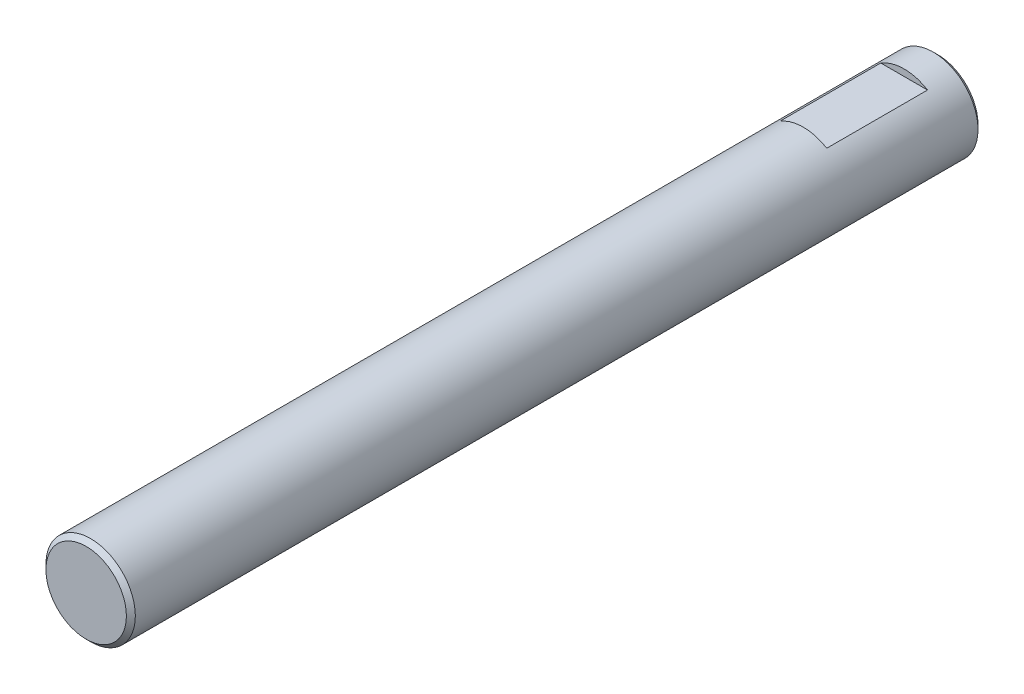
ISO-10303-21;
HEADER;
FILE_DESCRIPTION(('STEP AP214'),'2;1');
FILE_NAME('part.step','',(''),(''),'','','');
FILE_SCHEMA(('AUTOMOTIVE_DESIGN { 1 0 10303 214 1 1 1 1 }'));
ENDSEC;
DATA;
#1=APPLICATION_CONTEXT('core data for automotive mechanical design processes');
#2=APPLICATION_PROTOCOL_DEFINITION('international standard','automotive_design',2000,#1);
#3=PRODUCT_CONTEXT('',#1,'mechanical');
#4=PRODUCT('Part','Part','',(#3));
#5=PRODUCT_RELATED_PRODUCT_CATEGORY('part','',(#4));
#6=PRODUCT_DEFINITION_FORMATION('','',#4);
#7=PRODUCT_DEFINITION_CONTEXT('part definition',#1,'design');
#8=PRODUCT_DEFINITION('design','',#6,#7);
#9=PRODUCT_DEFINITION_SHAPE('','',#8);
#10=(LENGTH_UNIT() NAMED_UNIT(*) SI_UNIT(.MILLI.,.METRE.));
#11=(NAMED_UNIT(*) PLANE_ANGLE_UNIT() SI_UNIT($,.RADIAN.));
#12=(NAMED_UNIT(*) SI_UNIT($,.STERADIAN.) SOLID_ANGLE_UNIT());
#13=UNCERTAINTY_MEASURE_WITH_UNIT(LENGTH_MEASURE(1.E-05),#10,'distance_accuracy_value','');
#14=(GEOMETRIC_REPRESENTATION_CONTEXT(3) GLOBAL_UNCERTAINTY_ASSIGNED_CONTEXT((#13)) GLOBAL_UNIT_ASSIGNED_CONTEXT((#10,
#11,#12)) REPRESENTATION_CONTEXT('',''));
#15=CARTESIAN_POINT('',(0.,0.,0.));
#16=DIRECTION('',(0.,0.,1.));
#17=DIRECTION('',(1.,0.,0.));
#18=AXIS2_PLACEMENT_3D('',#15,#16,#17);
#19=CARTESIAN_POINT('',(0.,0.,38.));
#20=DIRECTION('',(0.,0.,-1.));
#21=DIRECTION('',(-1.,0.,0.));
#22=AXIS2_PLACEMENT_3D('',#19,#20,#21);
#23=CYLINDRICAL_SURFACE('',#22,1.995);
#24=CARTESIAN_POINT('',(0.,0.,37.8));
#25=DIRECTION('',(0.,0.,1.));
#26=DIRECTION('',(1.,0.,0.));
#27=AXIS2_PLACEMENT_3D('',#24,#25,#26);
#28=CIRCLE('',#27,1.995);
#29=CARTESIAN_POINT('',(1.995,0.,37.8));
#30=VERTEX_POINT('',#29);
#31=EDGE_CURVE('E51',#30,#30,#28,.F.);
#32=ORIENTED_EDGE('',*,*,#31,.T.);
#33=EDGE_LOOP('',(#32));
#34=FACE_BOUND('',#33,.T.);
#35=CARTESIAN_POINT('',(0.,0.,0.200000000000006));
#36=DIRECTION('',(0.,0.,1.));
#37=DIRECTION('',(1.,0.,0.));
#38=AXIS2_PLACEMENT_3D('',#35,#36,#37);
#39=CIRCLE('',#38,1.995);
#40=CARTESIAN_POINT('',(1.995,0.,0.200000000000006));
#41=VERTEX_POINT('',#40);
#42=EDGE_CURVE('E128',#41,#41,#39,.T.);
#43=ORIENTED_EDGE('',*,*,#42,.T.);
#44=EDGE_LOOP('',(#43));
#45=FACE_BOUND('',#44,.T.);
#46=DIRECTION('',(0.,0.,-1.));
#47=VECTOR('',#46,1.);
#48=CARTESIAN_POINT('',(-1.04404262365097,1.7,38.));
#49=LINE('',#48,#47);
#50=CARTESIAN_POINT('',(-1.04404262365097,1.7,6.));
#51=VERTEX_POINT('',#50);
#52=CARTESIAN_POINT('',(-1.04404262365097,1.7,1.5));
#53=VERTEX_POINT('',#52);
#54=EDGE_CURVE('E116',#51,#53,#49,.T.);
#55=ORIENTED_EDGE('',*,*,#54,.T.);
#56=CARTESIAN_POINT('',(0.,0.,1.5));
#57=DIRECTION('',(0.,0.,-1.));
#58=DIRECTION('',(-1.,0.,0.));
#59=AXIS2_PLACEMENT_3D('',#56,#57,#58);
#60=CIRCLE('',#59,1.995);
#61=CARTESIAN_POINT('',(1.04404262365097,1.7,1.5));
#62=VERTEX_POINT('',#61);
#63=EDGE_CURVE('E120',#53,#62,#60,.T.);
#64=ORIENTED_EDGE('',*,*,#63,.T.);
#65=DIRECTION('',(0.,0.,-1.));
#66=VECTOR('',#65,1.);
#67=CARTESIAN_POINT('',(1.04404262365097,1.7,38.));
#68=LINE('',#67,#66);
#69=CARTESIAN_POINT('',(1.04404262365097,1.7,6.));
#70=VERTEX_POINT('',#69);
#71=EDGE_CURVE('E112',#62,#70,#68,.F.);
#72=ORIENTED_EDGE('',*,*,#71,.T.);
#73=CARTESIAN_POINT('',(0.,0.,6.));
#74=DIRECTION('',(0.,0.,1.));
#75=DIRECTION('',(1.,0.,0.));
#76=AXIS2_PLACEMENT_3D('',#73,#74,#75);
#77=CIRCLE('',#76,1.995);
#78=EDGE_CURVE('E105',#70,#51,#77,.T.);
#79=ORIENTED_EDGE('',*,*,#78,.T.);
#80=EDGE_LOOP('',(#55,#64,#72,#79));
#81=FACE_BOUND('',#80,.T.);
#82=DIRECTION('',(0.,0.,-1.));
#83=VECTOR('',#82,1.);
#84=CARTESIAN_POINT('',(-1.04404262365097,-1.7,38.));
#85=LINE('',#84,#83);
#86=CARTESIAN_POINT('',(-1.04404262365097,-1.7,1.5));
#87=VERTEX_POINT('',#86);
#88=CARTESIAN_POINT('',(-1.04404262365097,-1.7,6.));
#89=VERTEX_POINT('',#88);
#90=EDGE_CURVE('E88',#87,#89,#85,.F.);
#91=ORIENTED_EDGE('',*,*,#90,.T.);
#92=CARTESIAN_POINT('',(0.,0.,6.));
#93=DIRECTION('',(0.,0.,1.));
#94=DIRECTION('',(1.,0.,0.));
#95=AXIS2_PLACEMENT_3D('',#92,#93,#94);
#96=CIRCLE('',#95,1.995);
#97=CARTESIAN_POINT('',(1.04404262365097,-1.7,6.));
#98=VERTEX_POINT('',#97);
#99=EDGE_CURVE('E100',#89,#98,#96,.T.);
#100=ORIENTED_EDGE('',*,*,#99,.T.);
#101=DIRECTION('',(0.,0.,-1.));
#102=VECTOR('',#101,1.);
#103=CARTESIAN_POINT('',(1.04404262365097,-1.7,38.));
#104=LINE('',#103,#102);
#105=CARTESIAN_POINT('',(1.04404262365097,-1.7,1.5));
#106=VERTEX_POINT('',#105);
#107=EDGE_CURVE('E94',#98,#106,#104,.T.);
#108=ORIENTED_EDGE('',*,*,#107,.T.);
#109=CARTESIAN_POINT('',(0.,0.,1.5));
#110=DIRECTION('',(0.,0.,-1.));
#111=DIRECTION('',(-1.,0.,0.));
#112=AXIS2_PLACEMENT_3D('',#109,#110,#111);
#113=CIRCLE('',#112,1.995);
#114=EDGE_CURVE('E82',#106,#87,#113,.T.);
#115=ORIENTED_EDGE('',*,*,#114,.T.);
#116=EDGE_LOOP('',(#91,#100,#108,#115));
#117=FACE_BOUND('',#116,.T.);
#118=ADVANCED_FACE('F41',(#34,#45,#81,#117),#23,.T.);
#119=CARTESIAN_POINT('',(0.,0.,38.));
#120=DIRECTION('',(0.,0.,1.));
#121=DIRECTION('',(1.,0.,0.));
#122=AXIS2_PLACEMENT_3D('',#119,#120,#121);
#123=PLANE('',#122);
#124=CARTESIAN_POINT('',(0.,0.,38.));
#125=DIRECTION('',(0.,0.,1.));
#126=DIRECTION('',(1.,0.,0.));
#127=AXIS2_PLACEMENT_3D('',#124,#125,#126);
#128=CIRCLE('',#127,1.795);
#129=CARTESIAN_POINT('',(1.795,0.,38.));
#130=VERTEX_POINT('',#129);
#131=EDGE_CURVE('E124',#130,#130,#128,.T.);
#132=ORIENTED_EDGE('',*,*,#131,.T.);
#133=EDGE_LOOP('',(#132));
#134=FACE_BOUND('',#133,.T.);
#135=ADVANCED_FACE('F143',(#134),#123,.T.);
#136=CARTESIAN_POINT('',(0.,0.,0.));
#137=DIRECTION('',(0.,0.,1.));
#138=DIRECTION('',(1.,0.,0.));
#139=AXIS2_PLACEMENT_3D('',#136,#137,#138);
#140=PLANE('',#139);
#141=CARTESIAN_POINT('',(0.,0.,0.));
#142=DIRECTION('',(0.,0.,1.));
#143=DIRECTION('',(1.,0.,0.));
#144=AXIS2_PLACEMENT_3D('',#141,#142,#143);
#145=CIRCLE('',#144,1.79499999999999);
#146=CARTESIAN_POINT('',(1.79499999999999,0.,0.));
#147=VERTEX_POINT('',#146);
#148=EDGE_CURVE('E11',#147,#147,#145,.F.);
#149=ORIENTED_EDGE('',*,*,#148,.T.);
#150=EDGE_LOOP('',(#149));
#151=FACE_BOUND('',#150,.T.);
#152=ADVANCED_FACE('F145',(#151),#140,.F.);
#153=CARTESIAN_POINT('',(-1.995,-2.62037787427485,6.));
#154=DIRECTION('',(0.,0.,1.));
#155=DIRECTION('',(1.,0.,0.));
#156=AXIS2_PLACEMENT_3D('',#153,#154,#155);
#157=PLANE('',#156);
#158=DIRECTION('',(1.,0.,0.));
#159=VECTOR('',#158,1.);
#160=CARTESIAN_POINT('',(-1.995,-1.7,6.));
#161=LINE('',#160,#159);
#162=EDGE_CURVE('E97',#89,#98,#161,.T.);
#163=ORIENTED_EDGE('',*,*,#162,.T.);
#164=ORIENTED_EDGE('',*,*,#99,.F.);
#165=EDGE_LOOP('',(#163,#164));
#166=FACE_BOUND('',#165,.T.);
#167=ADVANCED_FACE('F151',(#166),#157,.F.);
#168=CARTESIAN_POINT('',(-1.995,-1.7,1.5));
#169=DIRECTION('',(0.,1.,0.));
#170=DIRECTION('',(0.,0.,1.));
#171=AXIS2_PLACEMENT_3D('',#168,#169,#170);
#172=PLANE('',#171);
#173=ORIENTED_EDGE('',*,*,#162,.F.);
#174=ORIENTED_EDGE('',*,*,#90,.F.);
#175=DIRECTION('',(1.,0.,0.));
#176=VECTOR('',#175,1.);
#177=CARTESIAN_POINT('',(-1.995,-1.7,1.5));
#178=LINE('',#177,#176);
#179=EDGE_CURVE('E64',#87,#106,#178,.T.);
#180=ORIENTED_EDGE('',*,*,#179,.T.);
#181=ORIENTED_EDGE('',*,*,#107,.F.);
#182=EDGE_LOOP('',(#173,#174,#180,#181));
#183=FACE_BOUND('',#182,.T.);
#184=ADVANCED_FACE('F93',(#183),#172,.F.);
#185=CARTESIAN_POINT('',(-1.995,-2.62037787427485,1.5));
#186=DIRECTION('',(0.,0.,-1.));
#187=DIRECTION('',(-1.,0.,0.));
#188=AXIS2_PLACEMENT_3D('',#185,#186,#187);
#189=PLANE('',#188);
#190=ORIENTED_EDGE('',*,*,#179,.F.);
#191=ORIENTED_EDGE('',*,*,#114,.F.);
#192=EDGE_LOOP('',(#190,#191));
#193=FACE_BOUND('',#192,.T.);
#194=ADVANCED_FACE('F83',(#193),#189,.F.);
#195=CARTESIAN_POINT('',(-1.995,2.62037787427485,1.5));
#196=DIRECTION('',(0.,0.,-1.));
#197=DIRECTION('',(-1.,0.,0.));
#198=AXIS2_PLACEMENT_3D('',#195,#196,#197);
#199=PLANE('',#198);
#200=DIRECTION('',(1.,0.,0.));
#201=VECTOR('',#200,1.);
#202=CARTESIAN_POINT('',(-1.995,1.7,1.5));
#203=LINE('',#202,#201);
#204=EDGE_CURVE('E89',#53,#62,#203,.T.);
#205=ORIENTED_EDGE('',*,*,#204,.T.);
#206=ORIENTED_EDGE('',*,*,#63,.F.);
#207=EDGE_LOOP('',(#205,#206));
#208=FACE_BOUND('',#207,.T.);
#209=ADVANCED_FACE('F163',(#208),#199,.F.);
#210=CARTESIAN_POINT('',(-1.995,1.7,1.5));
#211=DIRECTION('',(0.,-1.,0.));
#212=DIRECTION('',(0.,0.,-1.));
#213=AXIS2_PLACEMENT_3D('',#210,#211,#212);
#214=PLANE('',#213);
#215=DIRECTION('',(1.,0.,0.));
#216=VECTOR('',#215,1.);
#217=CARTESIAN_POINT('',(-1.995,1.7,6.));
#218=LINE('',#217,#216);
#219=EDGE_CURVE('E57',#51,#70,#218,.T.);
#220=ORIENTED_EDGE('',*,*,#219,.T.);
#221=ORIENTED_EDGE('',*,*,#71,.F.);
#222=ORIENTED_EDGE('',*,*,#204,.F.);
#223=ORIENTED_EDGE('',*,*,#54,.F.);
#224=EDGE_LOOP('',(#220,#221,#222,#223));
#225=FACE_BOUND('',#224,.T.);
#226=ADVANCED_FACE('F171',(#225),#214,.F.);
#227=CARTESIAN_POINT('',(-1.995,2.62037787427485,6.));
#228=DIRECTION('',(0.,0.,1.));
#229=DIRECTION('',(1.,0.,0.));
#230=AXIS2_PLACEMENT_3D('',#227,#228,#229);
#231=PLANE('',#230);
#232=ORIENTED_EDGE('',*,*,#219,.F.);
#233=ORIENTED_EDGE('',*,*,#78,.F.);
#234=EDGE_LOOP('',(#232,#233));
#235=FACE_BOUND('',#234,.T.);
#236=ADVANCED_FACE('F140',(#235),#231,.F.);
#237=CARTESIAN_POINT('',(0.,0.,38.));
#238=DIRECTION('',(0.,0.,-1.));
#239=DIRECTION('',(-1.,0.,0.));
#240=AXIS2_PLACEMENT_3D('',#237,#238,#239);
#241=CONICAL_SURFACE('',#240,1.795,0.785398163397457);
#242=ORIENTED_EDGE('',*,*,#31,.F.);
#243=EDGE_LOOP('',(#242));
#244=FACE_BOUND('',#243,.T.);
#245=ORIENTED_EDGE('',*,*,#131,.F.);
#246=EDGE_LOOP('',(#245));
#247=FACE_BOUND('',#246,.T.);
#248=ADVANCED_FACE('F137',(#244,#247),#241,.T.);
#249=CARTESIAN_POINT('',(0.,0.,0.200000000000006));
#250=DIRECTION('',(0.,0.,1.));
#251=DIRECTION('',(1.,0.,0.));
#252=AXIS2_PLACEMENT_3D('',#249,#250,#251);
#253=CONICAL_SURFACE('',#252,1.995,0.785398163397448);
#254=ORIENTED_EDGE('',*,*,#148,.F.);
#255=EDGE_LOOP('',(#254));
#256=FACE_BOUND('',#255,.T.);
#257=ORIENTED_EDGE('',*,*,#42,.F.);
#258=EDGE_LOOP('',(#257));
#259=FACE_BOUND('',#258,.T.);
#260=ADVANCED_FACE('F44',(#256,#259),#253,.T.);
#261=CLOSED_SHELL('',(#118,#135,#152,#167,#184,#194,#209,#226,#236,#248,#260));
#262=MANIFOLD_SOLID_BREP('B2',#261);
#263=ADVANCED_BREP_SHAPE_REPRESENTATION('',(#18,#262),#14);
#264=SHAPE_DEFINITION_REPRESENTATION(#9,#263);
ENDSEC;
END-ISO-10303-21;
